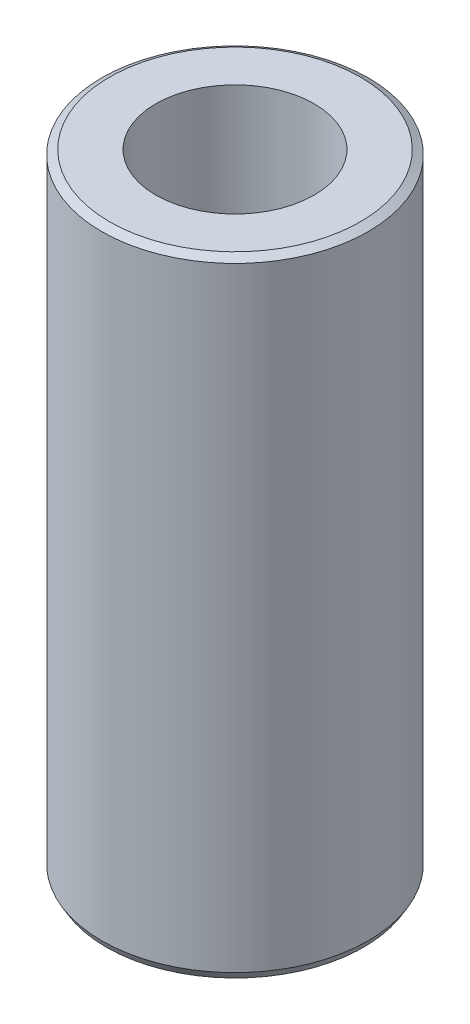
ISO-10303-21;
HEADER;
FILE_DESCRIPTION(('STEP AP214'),'2;1');
FILE_NAME('part.step','',(''),(''),'','','');
FILE_SCHEMA(('AUTOMOTIVE_DESIGN { 1 0 10303 214 1 1 1 1 }'));
ENDSEC;
DATA;
#1=APPLICATION_CONTEXT('core data for automotive mechanical design processes');
#2=APPLICATION_PROTOCOL_DEFINITION('international standard','automotive_design',2000,#1);
#3=PRODUCT_CONTEXT('',#1,'mechanical');
#4=PRODUCT('Part','Part','',(#3));
#5=PRODUCT_RELATED_PRODUCT_CATEGORY('part','',(#4));
#6=PRODUCT_DEFINITION_FORMATION('','',#4);
#7=PRODUCT_DEFINITION_CONTEXT('part definition',#1,'design');
#8=PRODUCT_DEFINITION('design','',#6,#7);
#9=PRODUCT_DEFINITION_SHAPE('','',#8);
#10=(LENGTH_UNIT() NAMED_UNIT(*) SI_UNIT(.MILLI.,.METRE.));
#11=(NAMED_UNIT(*) PLANE_ANGLE_UNIT() SI_UNIT($,.RADIAN.));
#12=(NAMED_UNIT(*) SI_UNIT($,.STERADIAN.) SOLID_ANGLE_UNIT());
#13=UNCERTAINTY_MEASURE_WITH_UNIT(LENGTH_MEASURE(1.E-05),#10,'distance_accuracy_value','');
#14=(GEOMETRIC_REPRESENTATION_CONTEXT(3) GLOBAL_UNCERTAINTY_ASSIGNED_CONTEXT((#13)) GLOBAL_UNIT_ASSIGNED_CONTEXT((#10,
#11,#12)) REPRESENTATION_CONTEXT('',''));
#15=CARTESIAN_POINT('',(0.,0.,0.));
#16=DIRECTION('',(0.,0.,1.));
#17=DIRECTION('',(1.,0.,0.));
#18=AXIS2_PLACEMENT_3D('',#15,#16,#17);
#19=CARTESIAN_POINT('',(0.,164.587406741275,0.));
#20=DIRECTION('',(0.,-1.,0.));
#21=DIRECTION('',(0.,0.,-1.));
#22=AXIS2_PLACEMENT_3D('',#19,#20,#21);
#23=CYLINDRICAL_SURFACE('',#22,35.);
#24=CARTESIAN_POINT('',(0.,163.396273850908,0.));
#25=DIRECTION('',(0.,1.,0.));
#26=DIRECTION('',(0.,0.,1.));
#27=AXIS2_PLACEMENT_3D('',#24,#25,#26);
#28=CIRCLE('',#27,35.);
#29=CARTESIAN_POINT('',(0.,163.396273850908,35.));
#30=VERTEX_POINT('',#29);
#31=EDGE_CURVE('E50',#30,#30,#28,.F.);
#32=ORIENTED_EDGE('',*,*,#31,.T.);
#33=EDGE_LOOP('',(#32));
#34=FACE_BOUND('',#33,.T.);
#35=CARTESIAN_POINT('',(0.,2.06310268468104,0.));
#36=DIRECTION('',(0.,1.,0.));
#37=DIRECTION('',(0.,0.,1.));
#38=AXIS2_PLACEMENT_3D('',#35,#36,#37);
#39=CIRCLE('',#38,35.);
#40=CARTESIAN_POINT('',(0.,2.06310268468104,35.));
#41=VERTEX_POINT('',#40);
#42=EDGE_CURVE('E51',#41,#41,#39,.T.);
#43=ORIENTED_EDGE('',*,*,#42,.T.);
#44=EDGE_LOOP('',(#43));
#45=FACE_BOUND('',#44,.T.);
#46=ADVANCED_FACE('F39',(#34,#45),#23,.T.);
#47=CARTESIAN_POINT('',(0.,164.587406741275,0.));
#48=DIRECTION('',(0.,1.,0.));
#49=DIRECTION('',(0.,0.,1.));
#50=AXIS2_PLACEMENT_3D('',#47,#48,#49);
#51=PLANE('',#50);
#52=CARTESIAN_POINT('',(0.,164.587406741275,0.));
#53=DIRECTION('',(0.,1.,0.));
#54=DIRECTION('',(0.,0.,1.));
#55=AXIS2_PLACEMENT_3D('',#52,#53,#54);
#56=CIRCLE('',#55,32.9368973153189);
#57=CARTESIAN_POINT('',(0.,164.587406741275,32.9368973153189));
#58=VERTEX_POINT('',#57);
#59=EDGE_CURVE('E54',#58,#58,#56,.T.);
#60=ORIENTED_EDGE('',*,*,#59,.T.);
#61=EDGE_LOOP('',(#60));
#62=FACE_BOUND('',#61,.T.);
#63=CARTESIAN_POINT('',(0.,164.587406741275,0.));
#64=DIRECTION('',(0.,1.,0.));
#65=DIRECTION('',(0.,0.,1.));
#66=AXIS2_PLACEMENT_3D('',#63,#64,#65);
#67=CIRCLE('',#66,20.796848535061);
#68=CARTESIAN_POINT('',(0.,164.587406741275,20.796848535061));
#69=VERTEX_POINT('',#68);
#70=EDGE_CURVE('E58',#69,#69,#67,.T.);
#71=ORIENTED_EDGE('',*,*,#70,.F.);
#72=EDGE_LOOP('',(#71));
#73=FACE_BOUND('',#72,.T.);
#74=ADVANCED_FACE('F69',(#62,#73),#51,.T.);
#75=CARTESIAN_POINT('',(0.,0.,0.));
#76=DIRECTION('',(0.,1.,0.));
#77=DIRECTION('',(0.,0.,1.));
#78=AXIS2_PLACEMENT_3D('',#75,#76,#77);
#79=PLANE('',#78);
#80=CARTESIAN_POINT('',(0.,0.,0.));
#81=DIRECTION('',(0.,1.,0.));
#82=DIRECTION('',(0.,0.,1.));
#83=AXIS2_PLACEMENT_3D('',#80,#81,#82);
#84=CIRCLE('',#83,33.8088671096335);
#85=CARTESIAN_POINT('',(0.,0.,33.8088671096335));
#86=VERTEX_POINT('',#85);
#87=EDGE_CURVE('E10',#86,#86,#84,.F.);
#88=ORIENTED_EDGE('',*,*,#87,.T.);
#89=EDGE_LOOP('',(#88));
#90=FACE_BOUND('',#89,.T.);
#91=CARTESIAN_POINT('',(0.,0.,0.));
#92=DIRECTION('',(0.,1.,0.));
#93=DIRECTION('',(0.,0.,1.));
#94=AXIS2_PLACEMENT_3D('',#91,#92,#93);
#95=CIRCLE('',#94,20.796848535061);
#96=CARTESIAN_POINT('',(0.,0.,20.796848535061));
#97=VERTEX_POINT('',#96);
#98=EDGE_CURVE('E63',#97,#97,#95,.T.);
#99=ORIENTED_EDGE('',*,*,#98,.T.);
#100=EDGE_LOOP('',(#99));
#101=FACE_BOUND('',#100,.T.);
#102=ADVANCED_FACE('F75',(#90,#101),#79,.F.);
#103=CARTESIAN_POINT('',(0.,164.587406741275,0.));
#104=DIRECTION('',(0.,-1.,0.));
#105=DIRECTION('',(0.,0.,-1.));
#106=AXIS2_PLACEMENT_3D('',#103,#104,#105);
#107=CYLINDRICAL_SURFACE('',#106,20.796848535061);
#108=ORIENTED_EDGE('',*,*,#70,.T.);
#109=EDGE_LOOP('',(#108));
#110=FACE_BOUND('',#109,.T.);
#111=ORIENTED_EDGE('',*,*,#98,.F.);
#112=EDGE_LOOP('',(#111));
#113=FACE_BOUND('',#112,.T.);
#114=ADVANCED_FACE('F70',(#110,#113),#107,.F.);
#115=CARTESIAN_POINT('',(0.,164.587406741275,0.));
#116=DIRECTION('',(0.,-1.,0.));
#117=DIRECTION('',(0.,0.,-1.));
#118=AXIS2_PLACEMENT_3D('',#115,#116,#117);
#119=CONICAL_SURFACE('',#118,32.9368973153189,1.04719755119659);
#120=ORIENTED_EDGE('',*,*,#31,.F.);
#121=EDGE_LOOP('',(#120));
#122=FACE_BOUND('',#121,.T.);
#123=ORIENTED_EDGE('',*,*,#59,.F.);
#124=EDGE_LOOP('',(#123));
#125=FACE_BOUND('',#124,.T.);
#126=ADVANCED_FACE('F81',(#122,#125),#119,.T.);
#127=CARTESIAN_POINT('',(0.,2.06310268468104,0.));
#128=DIRECTION('',(0.,1.,0.));
#129=DIRECTION('',(0.,0.,1.));
#130=AXIS2_PLACEMENT_3D('',#127,#128,#129);
#131=CONICAL_SURFACE('',#130,35.,0.523598775598308);
#132=ORIENTED_EDGE('',*,*,#87,.F.);
#133=EDGE_LOOP('',(#132));
#134=FACE_BOUND('',#133,.T.);
#135=ORIENTED_EDGE('',*,*,#42,.F.);
#136=EDGE_LOOP('',(#135));
#137=FACE_BOUND('',#136,.T.);
#138=ADVANCED_FACE('F45',(#134,#137),#131,.T.);
#139=CLOSED_SHELL('',(#46,#74,#102,#114,#126,#138));
#140=MANIFOLD_SOLID_BREP('B2',#139);
#141=ADVANCED_BREP_SHAPE_REPRESENTATION('',(#18,#140),#14);
#142=SHAPE_DEFINITION_REPRESENTATION(#9,#141);
ENDSEC;
END-ISO-10303-21;
